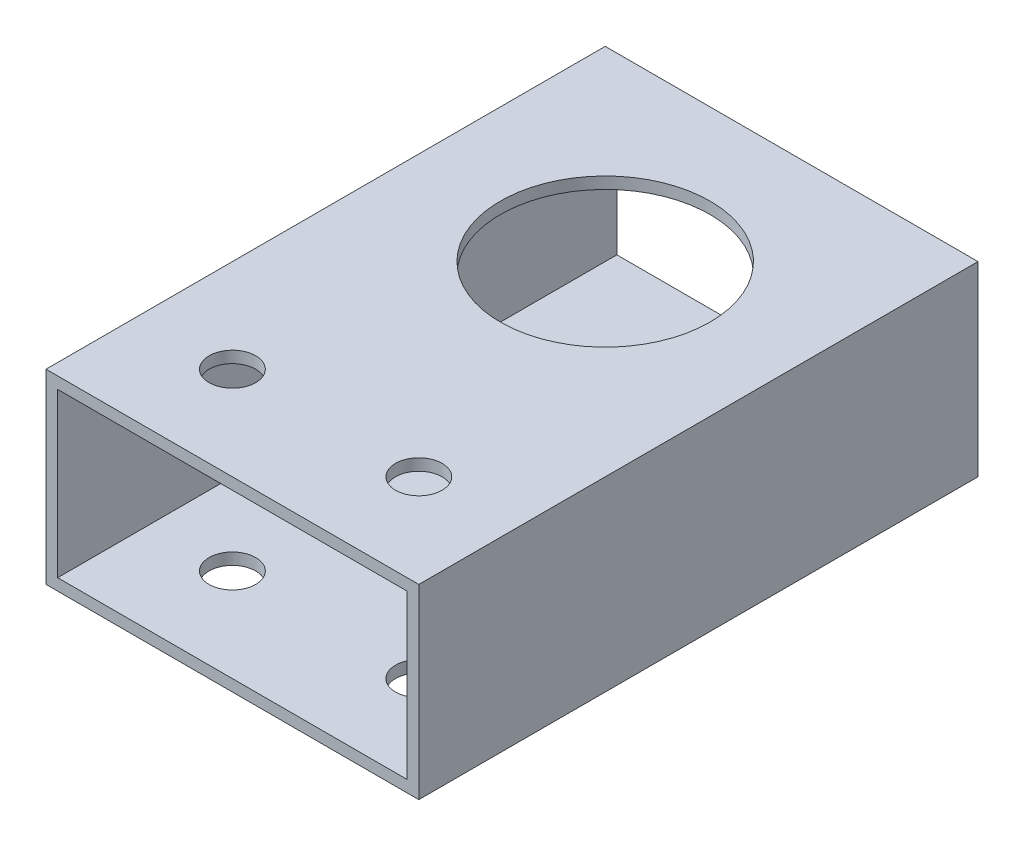
ISO-10303-21;
HEADER;
FILE_DESCRIPTION(('STEP AP214'),'2;1');
FILE_NAME('part.step','',(''),(''),'','','');
FILE_SCHEMA(('AUTOMOTIVE_DESIGN { 1 0 10303 214 1 1 1 1 }'));
ENDSEC;
DATA;
#1=APPLICATION_CONTEXT('core data for automotive mechanical design processes');
#2=APPLICATION_PROTOCOL_DEFINITION('international standard','automotive_design',2000,#1);
#3=PRODUCT_CONTEXT('',#1,'mechanical');
#4=PRODUCT('Part','Part','',(#3));
#5=PRODUCT_RELATED_PRODUCT_CATEGORY('part','',(#4));
#6=PRODUCT_DEFINITION_FORMATION('','',#4);
#7=PRODUCT_DEFINITION_CONTEXT('part definition',#1,'design');
#8=PRODUCT_DEFINITION('design','',#6,#7);
#9=PRODUCT_DEFINITION_SHAPE('','',#8);
#10=(LENGTH_UNIT() NAMED_UNIT(*) SI_UNIT(.MILLI.,.METRE.));
#11=(NAMED_UNIT(*) PLANE_ANGLE_UNIT() SI_UNIT($,.RADIAN.));
#12=(NAMED_UNIT(*) SI_UNIT($,.STERADIAN.) SOLID_ANGLE_UNIT());
#13=UNCERTAINTY_MEASURE_WITH_UNIT(LENGTH_MEASURE(1.E-05),#10,'distance_accuracy_value','');
#14=(GEOMETRIC_REPRESENTATION_CONTEXT(3) GLOBAL_UNCERTAINTY_ASSIGNED_CONTEXT((#13)) GLOBAL_UNIT_ASSIGNED_CONTEXT((#10,
#11,#12)) REPRESENTATION_CONTEXT('',''));
#15=CARTESIAN_POINT('',(0.,0.,0.));
#16=DIRECTION('',(0.,0.,1.));
#17=DIRECTION('',(1.,0.,0.));
#18=AXIS2_PLACEMENT_3D('',#15,#16,#17);
#19=CARTESIAN_POINT('',(0.,0.,-76.2));
#20=DIRECTION('',(0.,0.,-1.));
#21=DIRECTION('',(1.,0.,0.));
#22=AXIS2_PLACEMENT_3D('',#19,#20,#21);
#23=PLANE('',#22);
#24=DIRECTION('',(0.,-1.,0.));
#25=VECTOR('',#24,1.);
#26=CARTESIAN_POINT('',(-25.4,-12.7,-76.2));
#27=LINE('',#26,#25);
#28=CARTESIAN_POINT('',(-25.4,12.7,-76.2));
#29=VERTEX_POINT('',#28);
#30=CARTESIAN_POINT('',(-25.4,-12.7,-76.2));
#31=VERTEX_POINT('',#30);
#32=EDGE_CURVE('E138',#29,#31,#27,.T.);
#33=ORIENTED_EDGE('',*,*,#32,.F.);
#34=DIRECTION('',(-1.,0.,0.));
#35=VECTOR('',#34,1.);
#36=CARTESIAN_POINT('',(25.4,12.7,-76.2));
#37=LINE('',#36,#35);
#38=CARTESIAN_POINT('',(25.4,12.7,-76.2));
#39=VERTEX_POINT('',#38);
#40=EDGE_CURVE('E148',#39,#29,#37,.T.);
#41=ORIENTED_EDGE('',*,*,#40,.F.);
#42=DIRECTION('',(0.,1.,0.));
#43=VECTOR('',#42,1.);
#44=CARTESIAN_POINT('',(25.4,-12.7,-76.2));
#45=LINE('',#44,#43);
#46=CARTESIAN_POINT('',(25.4,-12.7,-76.2));
#47=VERTEX_POINT('',#46);
#48=EDGE_CURVE('E145',#47,#39,#45,.T.);
#49=ORIENTED_EDGE('',*,*,#48,.F.);
#50=DIRECTION('',(1.,0.,0.));
#51=VECTOR('',#50,1.);
#52=CARTESIAN_POINT('',(25.4,-12.7,-76.2));
#53=LINE('',#52,#51);
#54=EDGE_CURVE('E141',#31,#47,#53,.T.);
#55=ORIENTED_EDGE('',*,*,#54,.F.);
#56=EDGE_LOOP('',(#33,#41,#49,#55));
#57=FACE_BOUND('',#56,.T.);
#58=DIRECTION('',(1.,0.,0.));
#59=VECTOR('',#58,1.);
#60=CARTESIAN_POINT('',(23.8125,-11.1125,-76.2));
#61=LINE('',#60,#59);
#62=CARTESIAN_POINT('',(-23.8125,-11.1125,-76.2));
#63=VERTEX_POINT('',#62);
#64=CARTESIAN_POINT('',(23.8125,-11.1125,-76.2));
#65=VERTEX_POINT('',#64);
#66=EDGE_CURVE('E117',#63,#65,#61,.T.);
#67=ORIENTED_EDGE('',*,*,#66,.T.);
#68=DIRECTION('',(0.,1.,0.));
#69=VECTOR('',#68,1.);
#70=CARTESIAN_POINT('',(23.8125,-11.1125,-76.2));
#71=LINE('',#70,#69);
#72=CARTESIAN_POINT('',(23.8125,11.1125,-76.2));
#73=VERTEX_POINT('',#72);
#74=EDGE_CURVE('E122',#65,#73,#71,.T.);
#75=ORIENTED_EDGE('',*,*,#74,.T.);
#76=DIRECTION('',(-1.,0.,0.));
#77=VECTOR('',#76,1.);
#78=CARTESIAN_POINT('',(23.8125,11.1125,-76.2));
#79=LINE('',#78,#77);
#80=CARTESIAN_POINT('',(-23.8125,11.1125,-76.2));
#81=VERTEX_POINT('',#80);
#82=EDGE_CURVE('E118',#73,#81,#79,.T.);
#83=ORIENTED_EDGE('',*,*,#82,.T.);
#84=DIRECTION('',(0.,-1.,0.));
#85=VECTOR('',#84,1.);
#86=CARTESIAN_POINT('',(-23.8125,-11.1125,-76.2));
#87=LINE('',#86,#85);
#88=EDGE_CURVE('E103',#81,#63,#87,.T.);
#89=ORIENTED_EDGE('',*,*,#88,.T.);
#90=EDGE_LOOP('',(#67,#75,#83,#89));
#91=FACE_BOUND('',#90,.T.);
#92=ADVANCED_FACE('F35',(#57,#91),#23,.T.);
#93=CARTESIAN_POINT('',(0.,0.,0.));
#94=DIRECTION('',(0.,0.,-1.));
#95=DIRECTION('',(1.,0.,0.));
#96=AXIS2_PLACEMENT_3D('',#93,#94,#95);
#97=PLANE('',#96);
#98=DIRECTION('',(0.,-1.,0.));
#99=VECTOR('',#98,1.);
#100=CARTESIAN_POINT('',(-25.4,-12.7,0.));
#101=LINE('',#100,#99);
#102=CARTESIAN_POINT('',(-25.4,12.7,0.));
#103=VERTEX_POINT('',#102);
#104=CARTESIAN_POINT('',(-25.4,-12.7,0.));
#105=VERTEX_POINT('',#104);
#106=EDGE_CURVE('E111',#103,#105,#101,.T.);
#107=ORIENTED_EDGE('',*,*,#106,.T.);
#108=DIRECTION('',(1.,0.,0.));
#109=VECTOR('',#108,1.);
#110=CARTESIAN_POINT('',(25.4,-12.7,0.));
#111=LINE('',#110,#109);
#112=CARTESIAN_POINT('',(25.4,-12.7,0.));
#113=VERTEX_POINT('',#112);
#114=EDGE_CURVE('E154',#105,#113,#111,.T.);
#115=ORIENTED_EDGE('',*,*,#114,.T.);
#116=DIRECTION('',(0.,1.,0.));
#117=VECTOR('',#116,1.);
#118=CARTESIAN_POINT('',(25.4,-12.7,0.));
#119=LINE('',#118,#117);
#120=CARTESIAN_POINT('',(25.4,12.7,0.));
#121=VERTEX_POINT('',#120);
#122=EDGE_CURVE('E157',#113,#121,#119,.T.);
#123=ORIENTED_EDGE('',*,*,#122,.T.);
#124=DIRECTION('',(-1.,0.,0.));
#125=VECTOR('',#124,1.);
#126=CARTESIAN_POINT('',(25.4,12.7,0.));
#127=LINE('',#126,#125);
#128=EDGE_CURVE('E142',#121,#103,#127,.T.);
#129=ORIENTED_EDGE('',*,*,#128,.T.);
#130=EDGE_LOOP('',(#107,#115,#123,#129));
#131=FACE_BOUND('',#130,.T.);
#132=DIRECTION('',(0.,-1.,0.));
#133=VECTOR('',#132,1.);
#134=CARTESIAN_POINT('',(-23.8125,-11.1125,0.));
#135=LINE('',#134,#133);
#136=CARTESIAN_POINT('',(-23.8125,11.1125,0.));
#137=VERTEX_POINT('',#136);
#138=CARTESIAN_POINT('',(-23.8125,-11.1125,0.));
#139=VERTEX_POINT('',#138);
#140=EDGE_CURVE('E106',#137,#139,#135,.T.);
#141=ORIENTED_EDGE('',*,*,#140,.F.);
#142=DIRECTION('',(-1.,0.,0.));
#143=VECTOR('',#142,1.);
#144=CARTESIAN_POINT('',(23.8125,11.1125,0.));
#145=LINE('',#144,#143);
#146=CARTESIAN_POINT('',(23.8125,11.1125,0.));
#147=VERTEX_POINT('',#146);
#148=EDGE_CURVE('E119',#147,#137,#145,.T.);
#149=ORIENTED_EDGE('',*,*,#148,.F.);
#150=DIRECTION('',(0.,1.,0.));
#151=VECTOR('',#150,1.);
#152=CARTESIAN_POINT('',(23.8125,-11.1125,0.));
#153=LINE('',#152,#151);
#154=CARTESIAN_POINT('',(23.8125,-11.1125,0.));
#155=VERTEX_POINT('',#154);
#156=EDGE_CURVE('E132',#155,#147,#153,.T.);
#157=ORIENTED_EDGE('',*,*,#156,.F.);
#158=DIRECTION('',(1.,0.,0.));
#159=VECTOR('',#158,1.);
#160=CARTESIAN_POINT('',(23.8125,-11.1125,0.));
#161=LINE('',#160,#159);
#162=EDGE_CURVE('E129',#139,#155,#161,.T.);
#163=ORIENTED_EDGE('',*,*,#162,.F.);
#164=EDGE_LOOP('',(#141,#149,#157,#163));
#165=FACE_BOUND('',#164,.T.);
#166=ADVANCED_FACE('F218',(#131,#165),#97,.F.);
#167=CARTESIAN_POINT('',(-25.4,-12.7,-76.2));
#168=DIRECTION('',(1.,0.,0.));
#169=DIRECTION('',(0.,0.,1.));
#170=AXIS2_PLACEMENT_3D('',#167,#168,#169);
#171=PLANE('',#170);
#172=ORIENTED_EDGE('',*,*,#106,.F.);
#173=DIRECTION('',(0.,0.,1.));
#174=VECTOR('',#173,1.);
#175=CARTESIAN_POINT('',(-25.4,12.7,-76.2));
#176=LINE('',#175,#174);
#177=EDGE_CURVE('E151',#29,#103,#176,.T.);
#178=ORIENTED_EDGE('',*,*,#177,.F.);
#179=ORIENTED_EDGE('',*,*,#32,.T.);
#180=DIRECTION('',(0.,0.,1.));
#181=VECTOR('',#180,1.);
#182=CARTESIAN_POINT('',(-25.4,-12.7,-76.2));
#183=LINE('',#182,#181);
#184=EDGE_CURVE('E11',#31,#105,#183,.T.);
#185=ORIENTED_EDGE('',*,*,#184,.T.);
#186=EDGE_LOOP('',(#172,#178,#179,#185));
#187=FACE_BOUND('',#186,.T.);
#188=ADVANCED_FACE('F37',(#187),#171,.F.);
#189=CARTESIAN_POINT('',(25.4,-12.7,-76.2));
#190=DIRECTION('',(0.,1.,0.));
#191=DIRECTION('',(-1.,0.,0.));
#192=AXIS2_PLACEMENT_3D('',#189,#190,#191);
#193=PLANE('',#192);
#194=CARTESIAN_POINT('',(-12.7,-12.7,-12.7));
#195=DIRECTION('',(0.,-1.,0.));
#196=DIRECTION('',(-1.,0.,0.));
#197=AXIS2_PLACEMENT_3D('',#194,#195,#196);
#198=CIRCLE('',#197,3.175);
#199=CARTESIAN_POINT('',(-15.875,-12.7,-12.7));
#200=VERTEX_POINT('',#199);
#201=EDGE_CURVE('E183',#200,#200,#198,.T.);
#202=ORIENTED_EDGE('',*,*,#201,.F.);
#203=EDGE_LOOP('',(#202));
#204=FACE_BOUND('',#203,.T.);
#205=CARTESIAN_POINT('',(12.7,-12.7,-12.7));
#206=DIRECTION('',(0.,-1.,0.));
#207=DIRECTION('',(-1.,0.,0.));
#208=AXIS2_PLACEMENT_3D('',#205,#206,#207);
#209=CIRCLE('',#208,3.175);
#210=CARTESIAN_POINT('',(9.525,-12.7,-12.7));
#211=VERTEX_POINT('',#210);
#212=EDGE_CURVE('E172',#211,#211,#209,.T.);
#213=ORIENTED_EDGE('',*,*,#212,.F.);
#214=EDGE_LOOP('',(#213));
#215=FACE_BOUND('',#214,.T.);
#216=CARTESIAN_POINT('',(0.,-12.7,-50.8));
#217=DIRECTION('',(0.,1.,0.));
#218=DIRECTION('',(1.,0.,0.));
#219=AXIS2_PLACEMENT_3D('',#216,#217,#218);
#220=CIRCLE('',#219,14.2875);
#221=CARTESIAN_POINT('',(14.2875,-12.7,-50.8));
#222=VERTEX_POINT('',#221);
#223=EDGE_CURVE('E192',#222,#222,#220,.T.);
#224=ORIENTED_EDGE('',*,*,#223,.T.);
#225=EDGE_LOOP('',(#224));
#226=FACE_BOUND('',#225,.T.);
#227=ORIENTED_EDGE('',*,*,#114,.F.);
#228=ORIENTED_EDGE('',*,*,#184,.F.);
#229=ORIENTED_EDGE('',*,*,#54,.T.);
#230=DIRECTION('',(0.,0.,1.));
#231=VECTOR('',#230,1.);
#232=CARTESIAN_POINT('',(25.4,-12.7,-76.2));
#233=LINE('',#232,#231);
#234=EDGE_CURVE('E44',#47,#113,#233,.T.);
#235=ORIENTED_EDGE('',*,*,#234,.T.);
#236=EDGE_LOOP('',(#227,#228,#229,#235));
#237=FACE_BOUND('',#236,.T.);
#238=ADVANCED_FACE('F208',(#204,#215,#226,#237),#193,.F.);
#239=CARTESIAN_POINT('',(25.4,-12.7,-76.2));
#240=DIRECTION('',(-1.,0.,0.));
#241=DIRECTION('',(0.,0.,-1.));
#242=AXIS2_PLACEMENT_3D('',#239,#240,#241);
#243=PLANE('',#242);
#244=ORIENTED_EDGE('',*,*,#122,.F.);
#245=ORIENTED_EDGE('',*,*,#234,.F.);
#246=ORIENTED_EDGE('',*,*,#48,.T.);
#247=DIRECTION('',(0.,0.,1.));
#248=VECTOR('',#247,1.);
#249=CARTESIAN_POINT('',(25.4,12.7,-76.2));
#250=LINE('',#249,#248);
#251=EDGE_CURVE('E163',#39,#121,#250,.T.);
#252=ORIENTED_EDGE('',*,*,#251,.T.);
#253=EDGE_LOOP('',(#244,#245,#246,#252));
#254=FACE_BOUND('',#253,.T.);
#255=ADVANCED_FACE('F211',(#254),#243,.F.);
#256=CARTESIAN_POINT('',(25.4,12.7,-76.2));
#257=DIRECTION('',(0.,-1.,0.));
#258=DIRECTION('',(1.,0.,0.));
#259=AXIS2_PLACEMENT_3D('',#256,#257,#258);
#260=PLANE('',#259);
#261=CARTESIAN_POINT('',(-12.7,12.7,-12.7));
#262=DIRECTION('',(0.,-1.,0.));
#263=DIRECTION('',(-1.,0.,0.));
#264=AXIS2_PLACEMENT_3D('',#261,#262,#263);
#265=CIRCLE('',#264,3.175);
#266=CARTESIAN_POINT('',(-15.875,12.7,-12.7));
#267=VERTEX_POINT('',#266);
#268=EDGE_CURVE('E186',#267,#267,#265,.T.);
#269=ORIENTED_EDGE('',*,*,#268,.T.);
#270=EDGE_LOOP('',(#269));
#271=FACE_BOUND('',#270,.T.);
#272=CARTESIAN_POINT('',(12.7,12.7,-12.7));
#273=DIRECTION('',(0.,-1.,0.));
#274=DIRECTION('',(-1.,0.,0.));
#275=AXIS2_PLACEMENT_3D('',#272,#273,#274);
#276=CIRCLE('',#275,3.175);
#277=CARTESIAN_POINT('',(9.525,12.7,-12.7));
#278=VERTEX_POINT('',#277);
#279=EDGE_CURVE('E178',#278,#278,#276,.T.);
#280=ORIENTED_EDGE('',*,*,#279,.T.);
#281=EDGE_LOOP('',(#280));
#282=FACE_BOUND('',#281,.T.);
#283=CARTESIAN_POINT('',(0.,12.7,-50.8));
#284=DIRECTION('',(0.,1.,0.));
#285=DIRECTION('',(1.,0.,0.));
#286=AXIS2_PLACEMENT_3D('',#283,#284,#285);
#287=CIRCLE('',#286,14.2875);
#288=CARTESIAN_POINT('',(14.2875,12.7,-50.8));
#289=VERTEX_POINT('',#288);
#290=EDGE_CURVE('E168',#289,#289,#287,.T.);
#291=ORIENTED_EDGE('',*,*,#290,.F.);
#292=EDGE_LOOP('',(#291));
#293=FACE_BOUND('',#292,.T.);
#294=ORIENTED_EDGE('',*,*,#128,.F.);
#295=ORIENTED_EDGE('',*,*,#251,.F.);
#296=ORIENTED_EDGE('',*,*,#40,.T.);
#297=ORIENTED_EDGE('',*,*,#177,.T.);
#298=EDGE_LOOP('',(#294,#295,#296,#297));
#299=FACE_BOUND('',#298,.T.);
#300=ADVANCED_FACE('F228',(#271,#282,#293,#299),#260,.F.);
#301=CARTESIAN_POINT('',(-23.8125,-11.1125,-76.2));
#302=DIRECTION('',(1.,0.,0.));
#303=DIRECTION('',(0.,0.,1.));
#304=AXIS2_PLACEMENT_3D('',#301,#302,#303);
#305=PLANE('',#304);
#306=ORIENTED_EDGE('',*,*,#140,.T.);
#307=DIRECTION('',(0.,0.,1.));
#308=VECTOR('',#307,1.);
#309=CARTESIAN_POINT('',(-23.8125,-11.1125,-76.2));
#310=LINE('',#309,#308);
#311=EDGE_CURVE('E100',#63,#139,#310,.T.);
#312=ORIENTED_EDGE('',*,*,#311,.F.);
#313=ORIENTED_EDGE('',*,*,#88,.F.);
#314=DIRECTION('',(0.,0.,1.));
#315=VECTOR('',#314,1.);
#316=CARTESIAN_POINT('',(-23.8125,11.1125,-76.2));
#317=LINE('',#316,#315);
#318=EDGE_CURVE('E60',#81,#137,#317,.T.);
#319=ORIENTED_EDGE('',*,*,#318,.T.);
#320=EDGE_LOOP('',(#306,#312,#313,#319));
#321=FACE_BOUND('',#320,.T.);
#322=ADVANCED_FACE('F102',(#321),#305,.T.);
#323=CARTESIAN_POINT('',(23.8125,-11.1125,-76.2));
#324=DIRECTION('',(0.,1.,0.));
#325=DIRECTION('',(-1.,0.,0.));
#326=AXIS2_PLACEMENT_3D('',#323,#324,#325);
#327=PLANE('',#326);
#328=CARTESIAN_POINT('',(-12.7,-11.1125,-12.7));
#329=DIRECTION('',(0.,-1.,0.));
#330=DIRECTION('',(-1.,0.,0.));
#331=AXIS2_PLACEMENT_3D('',#328,#329,#330);
#332=CIRCLE('',#331,3.175);
#333=CARTESIAN_POINT('',(-15.875,-11.1125,-12.7));
#334=VERTEX_POINT('',#333);
#335=EDGE_CURVE('E189',#334,#334,#332,.T.);
#336=ORIENTED_EDGE('',*,*,#335,.T.);
#337=EDGE_LOOP('',(#336));
#338=FACE_BOUND('',#337,.T.);
#339=CARTESIAN_POINT('',(12.7,-11.1125,-12.7));
#340=DIRECTION('',(0.,-1.,0.));
#341=DIRECTION('',(-1.,0.,0.));
#342=AXIS2_PLACEMENT_3D('',#339,#340,#341);
#343=CIRCLE('',#342,3.175);
#344=CARTESIAN_POINT('',(9.525,-11.1125,-12.7));
#345=VERTEX_POINT('',#344);
#346=EDGE_CURVE('E171',#345,#345,#343,.T.);
#347=ORIENTED_EDGE('',*,*,#346,.T.);
#348=EDGE_LOOP('',(#347));
#349=FACE_BOUND('',#348,.T.);
#350=CARTESIAN_POINT('',(0.,-11.1125,-50.8));
#351=DIRECTION('',(0.,-1.,0.));
#352=DIRECTION('',(-1.,0.,0.));
#353=AXIS2_PLACEMENT_3D('',#350,#351,#352);
#354=CIRCLE('',#353,14.2875);
#355=CARTESIAN_POINT('',(-14.2875,-11.1125,-50.8));
#356=VERTEX_POINT('',#355);
#357=EDGE_CURVE('E130',#356,#356,#354,.T.);
#358=ORIENTED_EDGE('',*,*,#357,.T.);
#359=EDGE_LOOP('',(#358));
#360=FACE_BOUND('',#359,.T.);
#361=ORIENTED_EDGE('',*,*,#162,.T.);
#362=DIRECTION('',(0.,0.,1.));
#363=VECTOR('',#362,1.);
#364=CARTESIAN_POINT('',(23.8125,-11.1125,-76.2));
#365=LINE('',#364,#363);
#366=EDGE_CURVE('E112',#65,#155,#365,.T.);
#367=ORIENTED_EDGE('',*,*,#366,.F.);
#368=ORIENTED_EDGE('',*,*,#66,.F.);
#369=ORIENTED_EDGE('',*,*,#311,.T.);
#370=EDGE_LOOP('',(#361,#367,#368,#369));
#371=FACE_BOUND('',#370,.T.);
#372=ADVANCED_FACE('F121',(#338,#349,#360,#371),#327,.T.);
#373=CARTESIAN_POINT('',(23.8125,-11.1125,-76.2));
#374=DIRECTION('',(-1.,0.,0.));
#375=DIRECTION('',(0.,0.,-1.));
#376=AXIS2_PLACEMENT_3D('',#373,#374,#375);
#377=PLANE('',#376);
#378=ORIENTED_EDGE('',*,*,#156,.T.);
#379=DIRECTION('',(0.,0.,1.));
#380=VECTOR('',#379,1.);
#381=CARTESIAN_POINT('',(23.8125,11.1125,-76.2));
#382=LINE('',#381,#380);
#383=EDGE_CURVE('E52',#73,#147,#382,.T.);
#384=ORIENTED_EDGE('',*,*,#383,.F.);
#385=ORIENTED_EDGE('',*,*,#74,.F.);
#386=ORIENTED_EDGE('',*,*,#366,.T.);
#387=EDGE_LOOP('',(#378,#384,#385,#386));
#388=FACE_BOUND('',#387,.T.);
#389=ADVANCED_FACE('F249',(#388),#377,.T.);
#390=CARTESIAN_POINT('',(23.8125,11.1125,-76.2));
#391=DIRECTION('',(0.,-1.,0.));
#392=DIRECTION('',(1.,0.,0.));
#393=AXIS2_PLACEMENT_3D('',#390,#391,#392);
#394=PLANE('',#393);
#395=CARTESIAN_POINT('',(-12.7,11.1125,-12.7));
#396=DIRECTION('',(0.,1.,0.));
#397=DIRECTION('',(1.,0.,0.));
#398=AXIS2_PLACEMENT_3D('',#395,#396,#397);
#399=CIRCLE('',#398,3.175);
#400=CARTESIAN_POINT('',(-9.525,11.1125,-12.7));
#401=VERTEX_POINT('',#400);
#402=EDGE_CURVE('E39',#401,#401,#399,.T.);
#403=ORIENTED_EDGE('',*,*,#402,.T.);
#404=EDGE_LOOP('',(#403));
#405=FACE_BOUND('',#404,.T.);
#406=CARTESIAN_POINT('',(12.7,11.1125,-12.7));
#407=DIRECTION('',(0.,1.,0.));
#408=DIRECTION('',(1.,0.,0.));
#409=AXIS2_PLACEMENT_3D('',#406,#407,#408);
#410=CIRCLE('',#409,3.175);
#411=CARTESIAN_POINT('',(15.875,11.1125,-12.7));
#412=VERTEX_POINT('',#411);
#413=EDGE_CURVE('E169',#412,#412,#410,.T.);
#414=ORIENTED_EDGE('',*,*,#413,.T.);
#415=EDGE_LOOP('',(#414));
#416=FACE_BOUND('',#415,.T.);
#417=CARTESIAN_POINT('',(0.,11.1125,-50.8));
#418=DIRECTION('',(0.,1.,0.));
#419=DIRECTION('',(1.,0.,0.));
#420=AXIS2_PLACEMENT_3D('',#417,#418,#419);
#421=CIRCLE('',#420,14.2875);
#422=CARTESIAN_POINT('',(14.2875,11.1125,-50.8));
#423=VERTEX_POINT('',#422);
#424=EDGE_CURVE('E166',#423,#423,#421,.T.);
#425=ORIENTED_EDGE('',*,*,#424,.T.);
#426=EDGE_LOOP('',(#425));
#427=FACE_BOUND('',#426,.T.);
#428=ORIENTED_EDGE('',*,*,#148,.T.);
#429=ORIENTED_EDGE('',*,*,#318,.F.);
#430=ORIENTED_EDGE('',*,*,#82,.F.);
#431=ORIENTED_EDGE('',*,*,#383,.T.);
#432=EDGE_LOOP('',(#428,#429,#430,#431));
#433=FACE_BOUND('',#432,.T.);
#434=ADVANCED_FACE('F253',(#405,#416,#427,#433),#394,.T.);
#435=CARTESIAN_POINT('',(0.,12.7,-50.8));
#436=DIRECTION('',(0.,-1.,0.));
#437=DIRECTION('',(1.,0.,0.));
#438=AXIS2_PLACEMENT_3D('',#435,#436,#437);
#439=CYLINDRICAL_SURFACE('',#438,14.2875);
#440=ORIENTED_EDGE('',*,*,#424,.F.);
#441=EDGE_LOOP('',(#440));
#442=FACE_BOUND('',#441,.T.);
#443=ORIENTED_EDGE('',*,*,#290,.T.);
#444=EDGE_LOOP('',(#443));
#445=FACE_BOUND('',#444,.T.);
#446=ADVANCED_FACE('F204',(#442,#445),#439,.F.);
#447=ORIENTED_EDGE('',*,*,#357,.F.);
#448=EDGE_LOOP('',(#447));
#449=FACE_BOUND('',#448,.T.);
#450=ORIENTED_EDGE('',*,*,#223,.F.);
#451=EDGE_LOOP('',(#450));
#452=FACE_BOUND('',#451,.T.);
#453=ADVANCED_FACE('F200',(#449,#452),#439,.F.);
#454=CARTESIAN_POINT('',(12.7,-12.7,-12.7));
#455=DIRECTION('',(0.,1.,0.));
#456=DIRECTION('',(-1.,0.,0.));
#457=AXIS2_PLACEMENT_3D('',#454,#455,#456);
#458=CYLINDRICAL_SURFACE('',#457,3.175);
#459=ORIENTED_EDGE('',*,*,#413,.F.);
#460=EDGE_LOOP('',(#459));
#461=FACE_BOUND('',#460,.T.);
#462=ORIENTED_EDGE('',*,*,#279,.F.);
#463=EDGE_LOOP('',(#462));
#464=FACE_BOUND('',#463,.T.);
#465=ADVANCED_FACE('F203',(#461,#464),#458,.F.);
#466=CARTESIAN_POINT('',(-12.7,-12.7,-12.7));
#467=DIRECTION('',(0.,1.,0.));
#468=DIRECTION('',(-1.,0.,0.));
#469=AXIS2_PLACEMENT_3D('',#466,#467,#468);
#470=CYLINDRICAL_SURFACE('',#469,3.175);
#471=ORIENTED_EDGE('',*,*,#402,.F.);
#472=EDGE_LOOP('',(#471));
#473=FACE_BOUND('',#472,.T.);
#474=ORIENTED_EDGE('',*,*,#268,.F.);
#475=EDGE_LOOP('',(#474));
#476=FACE_BOUND('',#475,.T.);
#477=ADVANCED_FACE('F261',(#473,#476),#470,.F.);
#478=ORIENTED_EDGE('',*,*,#346,.F.);
#479=EDGE_LOOP('',(#478));
#480=FACE_BOUND('',#479,.T.);
#481=ORIENTED_EDGE('',*,*,#212,.T.);
#482=EDGE_LOOP('',(#481));
#483=FACE_BOUND('',#482,.T.);
#484=ADVANCED_FACE('F263',(#480,#483),#458,.F.);
#485=ORIENTED_EDGE('',*,*,#335,.F.);
#486=EDGE_LOOP('',(#485));
#487=FACE_BOUND('',#486,.T.);
#488=ORIENTED_EDGE('',*,*,#201,.T.);
#489=EDGE_LOOP('',(#488));
#490=FACE_BOUND('',#489,.T.);
#491=ADVANCED_FACE('F266',(#487,#490),#470,.F.);
#492=CLOSED_SHELL('',(#92,#166,#188,#238,#255,#300,#322,#372,#389,#434,#446,#453,#465,#477,#484,#491));
#493=MANIFOLD_SOLID_BREP('B2',#492);
#494=ADVANCED_BREP_SHAPE_REPRESENTATION('',(#18,#493),#14);
#495=SHAPE_DEFINITION_REPRESENTATION(#9,#494);
ENDSEC;
END-ISO-10303-21;
